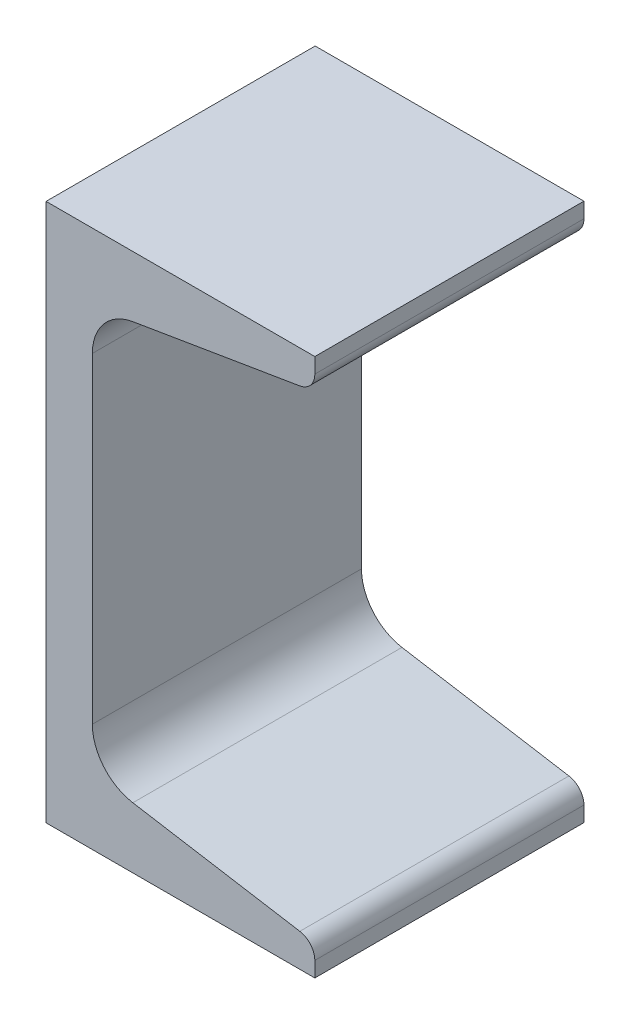
ISO-10303-21;
HEADER;
FILE_DESCRIPTION(('STEP AP214'),'2;1');
FILE_NAME('part.step','',(''),(''),'','','');
FILE_SCHEMA(('AUTOMOTIVE_DESIGN { 1 0 10303 214 1 1 1 1 }'));
ENDSEC;
DATA;
#1=APPLICATION_CONTEXT('core data for automotive mechanical design processes');
#2=APPLICATION_PROTOCOL_DEFINITION('international standard','automotive_design',2000,#1);
#3=PRODUCT_CONTEXT('',#1,'mechanical');
#4=PRODUCT('Part','Part','',(#3));
#5=PRODUCT_RELATED_PRODUCT_CATEGORY('part','',(#4));
#6=PRODUCT_DEFINITION_FORMATION('','',#4);
#7=PRODUCT_DEFINITION_CONTEXT('part definition',#1,'design');
#8=PRODUCT_DEFINITION('design','',#6,#7);
#9=PRODUCT_DEFINITION_SHAPE('','',#8);
#10=(LENGTH_UNIT() NAMED_UNIT(*) SI_UNIT(.MILLI.,.METRE.));
#11=(NAMED_UNIT(*) PLANE_ANGLE_UNIT() SI_UNIT($,.RADIAN.));
#12=(NAMED_UNIT(*) SI_UNIT($,.STERADIAN.) SOLID_ANGLE_UNIT());
#13=UNCERTAINTY_MEASURE_WITH_UNIT(LENGTH_MEASURE(1.E-05),#10,'distance_accuracy_value','');
#14=(GEOMETRIC_REPRESENTATION_CONTEXT(3) GLOBAL_UNCERTAINTY_ASSIGNED_CONTEXT((#13)) GLOBAL_UNIT_ASSIGNED_CONTEXT((#10,
#11,#12)) REPRESENTATION_CONTEXT('',''));
#15=CARTESIAN_POINT('',(0.,0.,0.));
#16=DIRECTION('',(0.,0.,1.));
#17=DIRECTION('',(1.,0.,0.));
#18=AXIS2_PLACEMENT_3D('',#15,#16,#17);
#19=CARTESIAN_POINT('',(0.,0.,19.05));
#20=DIRECTION('',(0.,1.,0.));
#21=DIRECTION('',(-1.,0.,0.));
#22=AXIS2_PLACEMENT_3D('',#19,#20,#21);
#23=PLANE('',#22);
#24=DIRECTION('',(1.,0.,0.));
#25=VECTOR('',#24,1.);
#26=CARTESIAN_POINT('',(0.,0.,-19.05));
#27=LINE('',#26,#25);
#28=CARTESIAN_POINT('',(0.,0.,-19.05));
#29=VERTEX_POINT('',#28);
#30=CARTESIAN_POINT('',(38.0492,0.,-19.05));
#31=VERTEX_POINT('',#30);
#32=EDGE_CURVE('E137',#29,#31,#27,.T.);
#33=ORIENTED_EDGE('',*,*,#32,.T.);
#34=DIRECTION('',(0.,0.,-1.));
#35=VECTOR('',#34,1.);
#36=CARTESIAN_POINT('',(38.0492,0.,19.05));
#37=LINE('',#36,#35);
#38=CARTESIAN_POINT('',(38.0492,0.,19.05));
#39=VERTEX_POINT('',#38);
#40=EDGE_CURVE('E11',#39,#31,#37,.T.);
#41=ORIENTED_EDGE('',*,*,#40,.F.);
#42=DIRECTION('',(1.,0.,0.));
#43=VECTOR('',#42,1.);
#44=CARTESIAN_POINT('',(0.,0.,19.05));
#45=LINE('',#44,#43);
#46=CARTESIAN_POINT('',(0.,0.,19.05));
#47=VERTEX_POINT('',#46);
#48=EDGE_CURVE('E159',#47,#39,#45,.T.);
#49=ORIENTED_EDGE('',*,*,#48,.F.);
#50=DIRECTION('',(0.,0.,-1.));
#51=VECTOR('',#50,1.);
#52=CARTESIAN_POINT('',(0.,0.,19.05));
#53=LINE('',#52,#51);
#54=EDGE_CURVE('E133',#47,#29,#53,.T.);
#55=ORIENTED_EDGE('',*,*,#54,.T.);
#56=EDGE_LOOP('',(#33,#41,#49,#55));
#57=FACE_BOUND('',#56,.T.);
#58=ADVANCED_FACE('F17',(#57),#23,.F.);
#59=CARTESIAN_POINT('',(38.0492,0.,19.05));
#60=DIRECTION('',(-1.,0.,0.));
#61=DIRECTION('',(0.,0.,1.));
#62=AXIS2_PLACEMENT_3D('',#59,#60,#61);
#63=PLANE('',#62);
#64=DIRECTION('',(0.,1.,0.));
#65=VECTOR('',#64,1.);
#66=CARTESIAN_POINT('',(38.0492,0.,-19.05));
#67=LINE('',#66,#65);
#68=CARTESIAN_POINT('',(38.0492,2.15766486416199,-19.05));
#69=VERTEX_POINT('',#68);
#70=EDGE_CURVE('E140',#31,#69,#67,.T.);
#71=ORIENTED_EDGE('',*,*,#70,.T.);
#72=DIRECTION('',(0.,0.,-1.));
#73=VECTOR('',#72,1.);
#74=CARTESIAN_POINT('',(38.0492,2.15766486416199,19.05));
#75=LINE('',#74,#73);
#76=CARTESIAN_POINT('',(38.0492,2.15766486416199,19.05));
#77=VERTEX_POINT('',#76);
#78=EDGE_CURVE('E25',#77,#69,#75,.T.);
#79=ORIENTED_EDGE('',*,*,#78,.F.);
#80=DIRECTION('',(0.,1.,0.));
#81=VECTOR('',#80,1.);
#82=CARTESIAN_POINT('',(38.0492,0.,19.05));
#83=LINE('',#82,#81);
#84=EDGE_CURVE('E88',#39,#77,#83,.T.);
#85=ORIENTED_EDGE('',*,*,#84,.F.);
#86=ORIENTED_EDGE('',*,*,#40,.T.);
#87=EDGE_LOOP('',(#71,#79,#85,#86));
#88=FACE_BOUND('',#87,.T.);
#89=ADVANCED_FACE('F239',(#88),#63,.F.);
#90=CARTESIAN_POINT('',(35.5092,2.15766486416199,19.05));
#91=DIRECTION('',(0.,0.,-1.));
#92=DIRECTION('',(-1.,0.,0.));
#93=AXIS2_PLACEMENT_3D('',#90,#91,#92);
#94=CYLINDRICAL_SURFACE('',#93,2.54);
#95=CARTESIAN_POINT('',(35.5092,2.15766486416199,-19.05));
#96=DIRECTION('',(0.,0.,1.));
#97=DIRECTION('',(1.,0.,0.));
#98=AXIS2_PLACEMENT_3D('',#95,#96,#97);
#99=CIRCLE('',#98,2.54);
#100=CARTESIAN_POINT('',(35.9268030663406,4.66310049075128,-19.05));
#101=VERTEX_POINT('',#100);
#102=EDGE_CURVE('E142',#69,#101,#99,.T.);
#103=ORIENTED_EDGE('',*,*,#102,.T.);
#104=DIRECTION('',(0.,0.,-1.));
#105=VECTOR('',#104,1.);
#106=CARTESIAN_POINT('',(35.9268030663406,4.66310049075128,19.05));
#107=LINE('',#106,#105);
#108=CARTESIAN_POINT('',(35.9268030663406,4.66310049075128,19.05));
#109=VERTEX_POINT('',#108);
#110=EDGE_CURVE('E178',#109,#101,#107,.T.);
#111=ORIENTED_EDGE('',*,*,#110,.F.);
#112=CARTESIAN_POINT('',(35.5092,2.15766486416199,19.05));
#113=DIRECTION('',(0.,0.,1.));
#114=DIRECTION('',(1.,0.,0.));
#115=AXIS2_PLACEMENT_3D('',#112,#113,#114);
#116=CIRCLE('',#115,2.54);
#117=EDGE_CURVE('E186',#77,#109,#116,.T.);
#118=ORIENTED_EDGE('',*,*,#117,.F.);
#119=ORIENTED_EDGE('',*,*,#78,.T.);
#120=EDGE_LOOP('',(#103,#111,#118,#119));
#121=FACE_BOUND('',#120,.T.);
#122=ADVANCED_FACE('F184',(#121),#94,.T.);
#123=CARTESIAN_POINT('',(12.2836717208802,8.60390984261646,19.05));
#124=DIRECTION('',(-0.16441065603963,-0.986391978972162,0.));
#125=DIRECTION('',(0.986391978972162,-0.16441065603963,0.));
#126=AXIS2_PLACEMENT_3D('',#123,#124,#125);
#127=PLANE('',#126);
#128=DIRECTION('',(-0.986391978972162,0.16441065603963,0.));
#129=VECTOR('',#128,1.);
#130=CARTESIAN_POINT('',(12.2836717208802,8.60390984261646,-19.05));
#131=LINE('',#130,#129);
#132=CARTESIAN_POINT('',(12.2836717208802,8.60390984261646,-19.05));
#133=VERTEX_POINT('',#132);
#134=EDGE_CURVE('E144',#101,#133,#131,.T.);
#135=ORIENTED_EDGE('',*,*,#134,.T.);
#136=DIRECTION('',(0.,0.,-1.));
#137=VECTOR('',#136,1.);
#138=CARTESIAN_POINT('',(12.2836717208802,8.60390984261646,19.05));
#139=LINE('',#138,#137);
#140=CARTESIAN_POINT('',(12.2836717208802,8.60390984261646,19.05));
#141=VERTEX_POINT('',#140);
#142=EDGE_CURVE('E175',#141,#133,#139,.T.);
#143=ORIENTED_EDGE('',*,*,#142,.F.);
#144=DIRECTION('',(-0.986391978972162,0.16441065603963,0.));
#145=VECTOR('',#144,1.);
#146=CARTESIAN_POINT('',(12.2836717208802,8.60390984261646,19.05));
#147=LINE('',#146,#145);
#148=EDGE_CURVE('E204',#109,#141,#147,.T.);
#149=ORIENTED_EDGE('',*,*,#148,.F.);
#150=ORIENTED_EDGE('',*,*,#110,.T.);
#151=EDGE_LOOP('',(#135,#143,#149,#150));
#152=FACE_BOUND('',#151,.T.);
#153=ADVANCED_FACE('F195',(#152),#127,.F.);
#154=CARTESIAN_POINT('',(13.4112,15.3685860344076,19.05));
#155=DIRECTION('',(0.,0.,-1.));
#156=DIRECTION('',(-1.,0.,0.));
#157=AXIS2_PLACEMENT_3D('',#154,#155,#156);
#158=CYLINDRICAL_SURFACE('',#157,6.858);
#159=CARTESIAN_POINT('',(13.4112,15.3685860344076,-19.05));
#160=DIRECTION('',(0.,0.,-1.));
#161=DIRECTION('',(1.,0.,0.));
#162=AXIS2_PLACEMENT_3D('',#159,#160,#161);
#163=CIRCLE('',#162,6.858);
#164=CARTESIAN_POINT('',(6.5532,15.3685860344076,-19.05));
#165=VERTEX_POINT('',#164);
#166=EDGE_CURVE('E146',#133,#165,#163,.T.);
#167=ORIENTED_EDGE('',*,*,#166,.T.);
#168=DIRECTION('',(0.,0.,-1.));
#169=VECTOR('',#168,1.);
#170=CARTESIAN_POINT('',(6.5532,15.3685860344076,19.05));
#171=LINE('',#170,#169);
#172=CARTESIAN_POINT('',(6.5532,15.3685860344076,19.05));
#173=VERTEX_POINT('',#172);
#174=EDGE_CURVE('E172',#173,#165,#171,.T.);
#175=ORIENTED_EDGE('',*,*,#174,.F.);
#176=CARTESIAN_POINT('',(13.4112,15.3685860344076,19.05));
#177=DIRECTION('',(0.,0.,-1.));
#178=DIRECTION('',(1.,0.,0.));
#179=AXIS2_PLACEMENT_3D('',#176,#177,#178);
#180=CIRCLE('',#179,6.858);
#181=EDGE_CURVE('E201',#141,#173,#180,.T.);
#182=ORIENTED_EDGE('',*,*,#181,.F.);
#183=ORIENTED_EDGE('',*,*,#142,.T.);
#184=EDGE_LOOP('',(#167,#175,#182,#183));
#185=FACE_BOUND('',#184,.T.);
#186=ADVANCED_FACE('F199',(#185),#158,.F.);
#187=CARTESIAN_POINT('',(6.5532,60.8314139655924,19.05));
#188=DIRECTION('',(-1.,0.,0.));
#189=DIRECTION('',(0.,-1.,0.));
#190=AXIS2_PLACEMENT_3D('',#187,#188,#189);
#191=PLANE('',#190);
#192=DIRECTION('',(0.,1.,0.));
#193=VECTOR('',#192,1.);
#194=CARTESIAN_POINT('',(6.5532,60.8314139655924,-19.05));
#195=LINE('',#194,#193);
#196=CARTESIAN_POINT('',(6.5532,60.8314139655924,-19.05));
#197=VERTEX_POINT('',#196);
#198=EDGE_CURVE('E148',#165,#197,#195,.T.);
#199=ORIENTED_EDGE('',*,*,#198,.T.);
#200=DIRECTION('',(0.,0.,-1.));
#201=VECTOR('',#200,1.);
#202=CARTESIAN_POINT('',(6.5532,60.8314139655924,19.05));
#203=LINE('',#202,#201);
#204=CARTESIAN_POINT('',(6.5532,60.8314139655924,19.05));
#205=VERTEX_POINT('',#204);
#206=EDGE_CURVE('E169',#205,#197,#203,.T.);
#207=ORIENTED_EDGE('',*,*,#206,.F.);
#208=DIRECTION('',(0.,1.,0.));
#209=VECTOR('',#208,1.);
#210=CARTESIAN_POINT('',(6.5532,60.8314139655924,19.05));
#211=LINE('',#210,#209);
#212=EDGE_CURVE('E203',#173,#205,#211,.T.);
#213=ORIENTED_EDGE('',*,*,#212,.F.);
#214=ORIENTED_EDGE('',*,*,#174,.T.);
#215=EDGE_LOOP('',(#199,#207,#213,#214));
#216=FACE_BOUND('',#215,.T.);
#217=ADVANCED_FACE('F254',(#216),#191,.F.);
#218=CARTESIAN_POINT('',(13.4112,60.8314139655924,19.05));
#219=DIRECTION('',(0.,0.,-1.));
#220=DIRECTION('',(-1.,0.,0.));
#221=AXIS2_PLACEMENT_3D('',#218,#219,#220);
#222=CYLINDRICAL_SURFACE('',#221,6.858);
#223=CARTESIAN_POINT('',(13.4112,60.8314139655924,-19.05));
#224=DIRECTION('',(0.,0.,-1.));
#225=DIRECTION('',(-1.,0.,0.));
#226=AXIS2_PLACEMENT_3D('',#223,#224,#225);
#227=CIRCLE('',#226,6.858);
#228=CARTESIAN_POINT('',(12.2836717208802,67.5960901573835,-19.05));
#229=VERTEX_POINT('',#228);
#230=EDGE_CURVE('E150',#197,#229,#227,.T.);
#231=ORIENTED_EDGE('',*,*,#230,.T.);
#232=DIRECTION('',(0.,0.,-1.));
#233=VECTOR('',#232,1.);
#234=CARTESIAN_POINT('',(12.2836717208802,67.5960901573835,19.05));
#235=LINE('',#234,#233);
#236=CARTESIAN_POINT('',(12.2836717208802,67.5960901573835,19.05));
#237=VERTEX_POINT('',#236);
#238=EDGE_CURVE('E166',#237,#229,#235,.T.);
#239=ORIENTED_EDGE('',*,*,#238,.F.);
#240=CARTESIAN_POINT('',(13.4112,60.8314139655924,19.05));
#241=DIRECTION('',(0.,0.,-1.));
#242=DIRECTION('',(-1.,0.,0.));
#243=AXIS2_PLACEMENT_3D('',#240,#241,#242);
#244=CIRCLE('',#243,6.858);
#245=EDGE_CURVE('E206',#205,#237,#244,.T.);
#246=ORIENTED_EDGE('',*,*,#245,.F.);
#247=ORIENTED_EDGE('',*,*,#206,.T.);
#248=EDGE_LOOP('',(#231,#239,#246,#247));
#249=FACE_BOUND('',#248,.T.);
#250=ADVANCED_FACE('F257',(#249),#222,.F.);
#251=CARTESIAN_POINT('',(12.2836717208802,67.5960901573835,19.05));
#252=DIRECTION('',(-0.164410656039631,0.986391978972162,0.));
#253=DIRECTION('',(-0.986391978972162,-0.164410656039631,0.));
#254=AXIS2_PLACEMENT_3D('',#251,#252,#253);
#255=PLANE('',#254);
#256=DIRECTION('',(0.986391978972162,0.164410656039631,0.));
#257=VECTOR('',#256,1.);
#258=CARTESIAN_POINT('',(12.2836717208802,67.5960901573835,-19.05));
#259=LINE('',#258,#257);
#260=CARTESIAN_POINT('',(35.9268030663406,71.5368995092487,-19.05));
#261=VERTEX_POINT('',#260);
#262=EDGE_CURVE('E152',#229,#261,#259,.T.);
#263=ORIENTED_EDGE('',*,*,#262,.T.);
#264=DIRECTION('',(0.,0.,-1.));
#265=VECTOR('',#264,1.);
#266=CARTESIAN_POINT('',(35.9268030663406,71.5368995092487,19.05));
#267=LINE('',#266,#265);
#268=CARTESIAN_POINT('',(35.9268030663406,71.5368995092487,19.05));
#269=VERTEX_POINT('',#268);
#270=EDGE_CURVE('E163',#269,#261,#267,.T.);
#271=ORIENTED_EDGE('',*,*,#270,.F.);
#272=DIRECTION('',(0.986391978972162,0.164410656039631,0.));
#273=VECTOR('',#272,1.);
#274=CARTESIAN_POINT('',(12.2836717208802,67.5960901573835,19.05));
#275=LINE('',#274,#273);
#276=EDGE_CURVE('E212',#237,#269,#275,.T.);
#277=ORIENTED_EDGE('',*,*,#276,.F.);
#278=ORIENTED_EDGE('',*,*,#238,.T.);
#279=EDGE_LOOP('',(#263,#271,#277,#278));
#280=FACE_BOUND('',#279,.T.);
#281=ADVANCED_FACE('F218',(#280),#255,.F.);
#282=CARTESIAN_POINT('',(35.5092,74.042335135838,19.05));
#283=DIRECTION('',(0.,0.,-1.));
#284=DIRECTION('',(-1.,0.,0.));
#285=AXIS2_PLACEMENT_3D('',#282,#283,#284);
#286=CYLINDRICAL_SURFACE('',#285,2.54);
#287=CARTESIAN_POINT('',(35.5092,74.042335135838,-19.05));
#288=DIRECTION('',(0.,0.,1.));
#289=DIRECTION('',(-1.,0.,0.));
#290=AXIS2_PLACEMENT_3D('',#287,#288,#289);
#291=CIRCLE('',#290,2.54);
#292=CARTESIAN_POINT('',(38.0492,74.042335135838,-19.05));
#293=VERTEX_POINT('',#292);
#294=EDGE_CURVE('E154',#261,#293,#291,.T.);
#295=ORIENTED_EDGE('',*,*,#294,.T.);
#296=DIRECTION('',(0.,0.,-1.));
#297=VECTOR('',#296,1.);
#298=CARTESIAN_POINT('',(38.0492,74.042335135838,19.05));
#299=LINE('',#298,#297);
#300=CARTESIAN_POINT('',(38.0492,74.042335135838,19.05));
#301=VERTEX_POINT('',#300);
#302=EDGE_CURVE('E128',#301,#293,#299,.T.);
#303=ORIENTED_EDGE('',*,*,#302,.F.);
#304=CARTESIAN_POINT('',(35.5092,74.042335135838,19.05));
#305=DIRECTION('',(0.,0.,1.));
#306=DIRECTION('',(-1.,0.,0.));
#307=AXIS2_PLACEMENT_3D('',#304,#305,#306);
#308=CIRCLE('',#307,2.54);
#309=EDGE_CURVE('E119',#269,#301,#308,.T.);
#310=ORIENTED_EDGE('',*,*,#309,.F.);
#311=ORIENTED_EDGE('',*,*,#270,.T.);
#312=EDGE_LOOP('',(#295,#303,#310,#311));
#313=FACE_BOUND('',#312,.T.);
#314=ADVANCED_FACE('F222',(#313),#286,.T.);
#315=CARTESIAN_POINT('',(38.0492,76.2,19.05));
#316=DIRECTION('',(-1.,0.,0.));
#317=DIRECTION('',(0.,-1.,0.));
#318=AXIS2_PLACEMENT_3D('',#315,#316,#317);
#319=PLANE('',#318);
#320=DIRECTION('',(0.,1.,0.));
#321=VECTOR('',#320,1.);
#322=CARTESIAN_POINT('',(38.0492,76.2,-19.05));
#323=LINE('',#322,#321);
#324=CARTESIAN_POINT('',(38.0492,76.2,-19.05));
#325=VERTEX_POINT('',#324);
#326=EDGE_CURVE('E127',#293,#325,#323,.T.);
#327=ORIENTED_EDGE('',*,*,#326,.T.);
#328=DIRECTION('',(0.,0.,-1.));
#329=VECTOR('',#328,1.);
#330=CARTESIAN_POINT('',(38.0492,76.2,19.05));
#331=LINE('',#330,#329);
#332=CARTESIAN_POINT('',(38.0492,76.2,19.05));
#333=VERTEX_POINT('',#332);
#334=EDGE_CURVE('E124',#333,#325,#331,.T.);
#335=ORIENTED_EDGE('',*,*,#334,.F.);
#336=DIRECTION('',(0.,1.,0.));
#337=VECTOR('',#336,1.);
#338=CARTESIAN_POINT('',(38.0492,76.2,19.05));
#339=LINE('',#338,#337);
#340=EDGE_CURVE('E113',#301,#333,#339,.T.);
#341=ORIENTED_EDGE('',*,*,#340,.F.);
#342=ORIENTED_EDGE('',*,*,#302,.T.);
#343=EDGE_LOOP('',(#327,#335,#341,#342));
#344=FACE_BOUND('',#343,.T.);
#345=ADVANCED_FACE('F125',(#344),#319,.F.);
#346=CARTESIAN_POINT('',(0.,76.2,19.05));
#347=DIRECTION('',(0.,-1.,0.));
#348=DIRECTION('',(0.,0.,-1.));
#349=AXIS2_PLACEMENT_3D('',#346,#347,#348);
#350=PLANE('',#349);
#351=DIRECTION('',(-1.,0.,0.));
#352=VECTOR('',#351,1.);
#353=CARTESIAN_POINT('',(0.,76.2,-19.05));
#354=LINE('',#353,#352);
#355=CARTESIAN_POINT('',(0.,76.2,-19.05));
#356=VERTEX_POINT('',#355);
#357=EDGE_CURVE('E74',#325,#356,#354,.T.);
#358=ORIENTED_EDGE('',*,*,#357,.T.);
#359=DIRECTION('',(0.,0.,-1.));
#360=VECTOR('',#359,1.);
#361=CARTESIAN_POINT('',(0.,76.2,19.05));
#362=LINE('',#361,#360);
#363=CARTESIAN_POINT('',(0.,76.2,19.05));
#364=VERTEX_POINT('',#363);
#365=EDGE_CURVE('E129',#364,#356,#362,.T.);
#366=ORIENTED_EDGE('',*,*,#365,.F.);
#367=DIRECTION('',(-1.,0.,0.));
#368=VECTOR('',#367,1.);
#369=CARTESIAN_POINT('',(0.,76.2,19.05));
#370=LINE('',#369,#368);
#371=EDGE_CURVE('E117',#333,#364,#370,.T.);
#372=ORIENTED_EDGE('',*,*,#371,.F.);
#373=ORIENTED_EDGE('',*,*,#334,.T.);
#374=EDGE_LOOP('',(#358,#366,#372,#373));
#375=FACE_BOUND('',#374,.T.);
#376=ADVANCED_FACE('F131',(#375),#350,.F.);
#377=CARTESIAN_POINT('',(0.,0.,19.05));
#378=DIRECTION('',(1.,0.,0.));
#379=DIRECTION('',(0.,1.,0.));
#380=AXIS2_PLACEMENT_3D('',#377,#378,#379);
#381=PLANE('',#380);
#382=DIRECTION('',(0.,-1.,0.));
#383=VECTOR('',#382,1.);
#384=CARTESIAN_POINT('',(0.,0.,-19.05));
#385=LINE('',#384,#383);
#386=EDGE_CURVE('E80',#356,#29,#385,.T.);
#387=ORIENTED_EDGE('',*,*,#386,.T.);
#388=ORIENTED_EDGE('',*,*,#54,.F.);
#389=DIRECTION('',(0.,-1.,0.));
#390=VECTOR('',#389,1.);
#391=CARTESIAN_POINT('',(0.,0.,19.05));
#392=LINE('',#391,#390);
#393=EDGE_CURVE('E33',#364,#47,#392,.T.);
#394=ORIENTED_EDGE('',*,*,#393,.F.);
#395=ORIENTED_EDGE('',*,*,#365,.T.);
#396=EDGE_LOOP('',(#387,#388,#394,#395));
#397=FACE_BOUND('',#396,.T.);
#398=ADVANCED_FACE('F226',(#397),#381,.F.);
#399=CARTESIAN_POINT('',(35.5092,2.15766486416199,19.05));
#400=DIRECTION('',(0.,0.,1.));
#401=DIRECTION('',(1.,0.,0.));
#402=AXIS2_PLACEMENT_3D('',#399,#400,#401);
#403=PLANE('',#402);
#404=ORIENTED_EDGE('',*,*,#48,.T.);
#405=ORIENTED_EDGE('',*,*,#84,.T.);
#406=ORIENTED_EDGE('',*,*,#117,.T.);
#407=ORIENTED_EDGE('',*,*,#148,.T.);
#408=ORIENTED_EDGE('',*,*,#181,.T.);
#409=ORIENTED_EDGE('',*,*,#212,.T.);
#410=ORIENTED_EDGE('',*,*,#245,.T.);
#411=ORIENTED_EDGE('',*,*,#276,.T.);
#412=ORIENTED_EDGE('',*,*,#309,.T.);
#413=ORIENTED_EDGE('',*,*,#340,.T.);
#414=ORIENTED_EDGE('',*,*,#371,.T.);
#415=ORIENTED_EDGE('',*,*,#393,.T.);
#416=EDGE_LOOP('',(#404,#405,#406,#407,#408,#409,#410,#411,#412,#413,#414,#415));
#417=FACE_BOUND('',#416,.T.);
#418=ADVANCED_FACE('F115',(#417),#403,.T.);
#419=CARTESIAN_POINT('',(35.5092,2.15766486416199,-19.05));
#420=DIRECTION('',(0.,0.,1.));
#421=DIRECTION('',(1.,0.,0.));
#422=AXIS2_PLACEMENT_3D('',#419,#420,#421);
#423=PLANE('',#422);
#424=ORIENTED_EDGE('',*,*,#32,.F.);
#425=ORIENTED_EDGE('',*,*,#386,.F.);
#426=ORIENTED_EDGE('',*,*,#357,.F.);
#427=ORIENTED_EDGE('',*,*,#326,.F.);
#428=ORIENTED_EDGE('',*,*,#294,.F.);
#429=ORIENTED_EDGE('',*,*,#262,.F.);
#430=ORIENTED_EDGE('',*,*,#230,.F.);
#431=ORIENTED_EDGE('',*,*,#198,.F.);
#432=ORIENTED_EDGE('',*,*,#166,.F.);
#433=ORIENTED_EDGE('',*,*,#134,.F.);
#434=ORIENTED_EDGE('',*,*,#102,.F.);
#435=ORIENTED_EDGE('',*,*,#70,.F.);
#436=EDGE_LOOP('',(#424,#425,#426,#427,#428,#429,#430,#431,#432,#433,#434,#435));
#437=FACE_BOUND('',#436,.T.);
#438=ADVANCED_FACE('F190',(#437),#423,.F.);
#439=CLOSED_SHELL('',(#58,#89,#122,#153,#186,#217,#250,#281,#314,#345,#376,#398,#418,#438));
#440=MANIFOLD_SOLID_BREP('B1',#439);
#441=ADVANCED_BREP_SHAPE_REPRESENTATION('',(#18,#440),#14);
#442=SHAPE_DEFINITION_REPRESENTATION(#9,#441);
ENDSEC;
END-ISO-10303-21;
